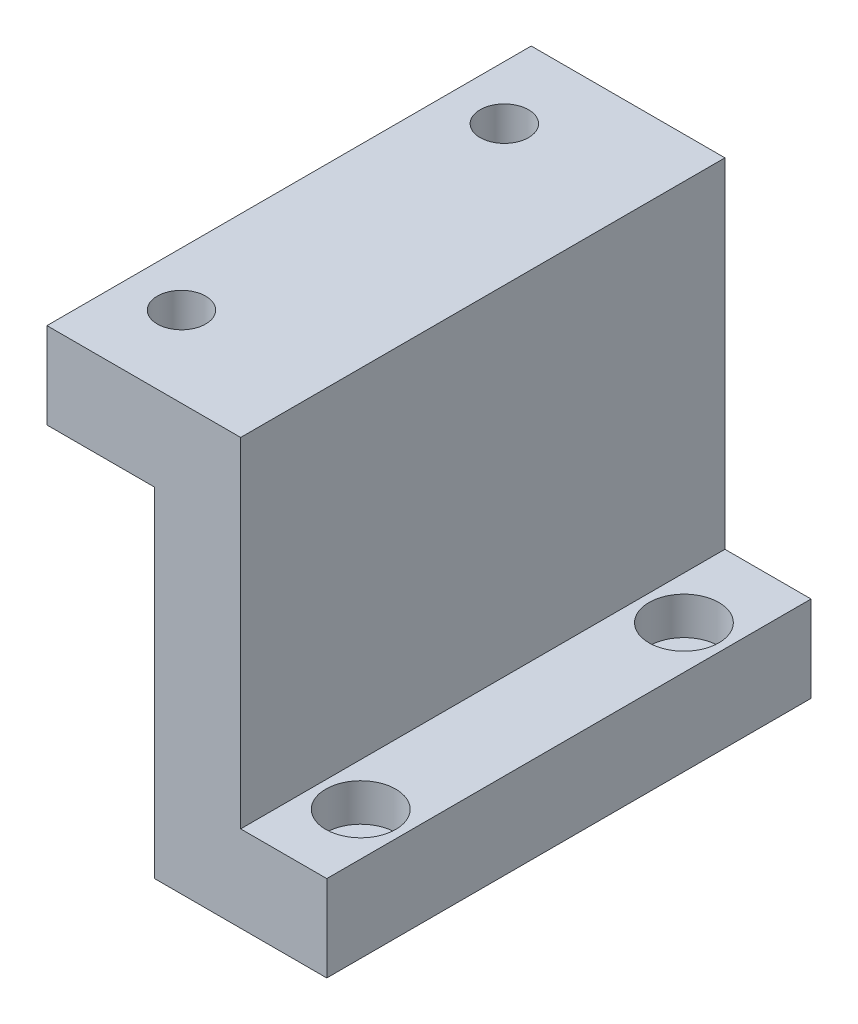
ISO-10303-21;
HEADER;
FILE_DESCRIPTION(('STEP AP214'),'2;1');
FILE_NAME('part.step','',(''),(''),'','','');
FILE_SCHEMA(('AUTOMOTIVE_DESIGN { 1 0 10303 214 1 1 1 1 }'));
ENDSEC;
DATA;
#1=APPLICATION_CONTEXT('core data for automotive mechanical design processes');
#2=APPLICATION_PROTOCOL_DEFINITION('international standard','automotive_design',2000,#1);
#3=PRODUCT_CONTEXT('',#1,'mechanical');
#4=PRODUCT('Part','Part','',(#3));
#5=PRODUCT_RELATED_PRODUCT_CATEGORY('part','',(#4));
#6=PRODUCT_DEFINITION_FORMATION('','',#4);
#7=PRODUCT_DEFINITION_CONTEXT('part definition',#1,'design');
#8=PRODUCT_DEFINITION('design','',#6,#7);
#9=PRODUCT_DEFINITION_SHAPE('','',#8);
#10=(LENGTH_UNIT() NAMED_UNIT(*) SI_UNIT(.MILLI.,.METRE.));
#11=(NAMED_UNIT(*) PLANE_ANGLE_UNIT() SI_UNIT($,.RADIAN.));
#12=(NAMED_UNIT(*) SI_UNIT($,.STERADIAN.) SOLID_ANGLE_UNIT());
#13=UNCERTAINTY_MEASURE_WITH_UNIT(LENGTH_MEASURE(1.E-05),#10,'distance_accuracy_value','');
#14=(GEOMETRIC_REPRESENTATION_CONTEXT(3) GLOBAL_UNCERTAINTY_ASSIGNED_CONTEXT((#13)) GLOBAL_UNIT_ASSIGNED_CONTEXT((#10,
#11,#12)) REPRESENTATION_CONTEXT('',''));
#15=CARTESIAN_POINT('',(0.,0.,0.));
#16=DIRECTION('',(0.,0.,1.));
#17=DIRECTION('',(1.,0.,0.));
#18=AXIS2_PLACEMENT_3D('',#15,#16,#17);
#19=CARTESIAN_POINT('',(17.4113924050633,-67.9588607594937,37.8432212693269));
#20=DIRECTION('',(0.,1.,0.));
#21=DIRECTION('',(0.,0.,1.));
#22=AXIS2_PLACEMENT_3D('',#19,#20,#21);
#23=CYLINDRICAL_SURFACE('',#22,1.7);
#24=CARTESIAN_POINT('',(17.4113924050633,-30.9588607594937,37.8432212693269));
#25=DIRECTION('',(0.,1.,0.));
#26=DIRECTION('',(-1.,0.,0.));
#27=AXIS2_PLACEMENT_3D('',#24,#25,#26);
#28=CIRCLE('',#27,1.7);
#29=CARTESIAN_POINT('',(15.7113924050633,-30.9588607594937,37.8432212693269));
#30=VERTEX_POINT('',#29);
#31=EDGE_CURVE('E160',#30,#30,#28,.T.);
#32=ORIENTED_EDGE('',*,*,#31,.F.);
#33=EDGE_LOOP('',(#32));
#34=FACE_BOUND('',#33,.T.);
#35=CARTESIAN_POINT('',(17.4113924050633,-26.4588607594937,37.8432212693269));
#36=DIRECTION('',(0.,1.,0.));
#37=DIRECTION('',(0.,0.,1.));
#38=AXIS2_PLACEMENT_3D('',#35,#36,#37);
#39=CIRCLE('',#38,1.7);
#40=CARTESIAN_POINT('',(17.4113924050633,-26.4588607594937,39.5432212693269));
#41=VERTEX_POINT('',#40);
#42=EDGE_CURVE('E37',#41,#41,#39,.F.);
#43=ORIENTED_EDGE('',*,*,#42,.F.);
#44=EDGE_LOOP('',(#43));
#45=FACE_BOUND('',#44,.T.);
#46=ADVANCED_FACE('F33',(#34,#45),#23,.F.);
#47=CARTESIAN_POINT('',(17.4113924050633,-67.9588607594937,7.81059951685847));
#48=DIRECTION('',(0.,1.,0.));
#49=DIRECTION('',(0.,0.,1.));
#50=AXIS2_PLACEMENT_3D('',#47,#48,#49);
#51=CYLINDRICAL_SURFACE('',#50,1.7);
#52=CARTESIAN_POINT('',(17.4113924050633,-30.9588607594937,7.81059951685847));
#53=DIRECTION('',(0.,1.,0.));
#54=DIRECTION('',(-1.,0.,0.));
#55=AXIS2_PLACEMENT_3D('',#52,#53,#54);
#56=CIRCLE('',#55,1.7);
#57=CARTESIAN_POINT('',(15.7113924050633,-30.9588607594937,7.81059951685847));
#58=VERTEX_POINT('',#57);
#59=EDGE_CURVE('E165',#58,#58,#56,.T.);
#60=ORIENTED_EDGE('',*,*,#59,.F.);
#61=EDGE_LOOP('',(#60));
#62=FACE_BOUND('',#61,.T.);
#63=CARTESIAN_POINT('',(17.4113924050633,-26.4588607594937,7.81059951685847));
#64=DIRECTION('',(0.,1.,0.));
#65=DIRECTION('',(0.,0.,1.));
#66=AXIS2_PLACEMENT_3D('',#63,#64,#65);
#67=CIRCLE('',#66,1.7);
#68=CARTESIAN_POINT('',(17.4113924050633,-26.4588607594937,9.51059951685847));
#69=VERTEX_POINT('',#68);
#70=EDGE_CURVE('E158',#69,#69,#67,.F.);
#71=ORIENTED_EDGE('',*,*,#70,.F.);
#72=EDGE_LOOP('',(#71));
#73=FACE_BOUND('',#72,.T.);
#74=ADVANCED_FACE('F227',(#62,#73),#51,.F.);
#75=CARTESIAN_POINT('',(-4.5886075949367,8.54113924050633,45.));
#76=DIRECTION('',(1.,0.,0.));
#77=DIRECTION('',(0.,1.,0.));
#78=AXIS2_PLACEMENT_3D('',#75,#76,#77);
#79=PLANE('',#78);
#80=DIRECTION('',(0.,-1.,0.));
#81=VECTOR('',#80,1.);
#82=CARTESIAN_POINT('',(-4.5886075949367,8.54113924050633,0.));
#83=LINE('',#82,#81);
#84=CARTESIAN_POINT('',(-4.5886075949367,8.54113924050633,0.));
#85=VERTEX_POINT('',#84);
#86=CARTESIAN_POINT('',(-4.5886075949367,0.541139240506329,0.));
#87=VERTEX_POINT('',#86);
#88=EDGE_CURVE('E132',#85,#87,#83,.T.);
#89=ORIENTED_EDGE('',*,*,#88,.T.);
#90=DIRECTION('',(0.,0.,-1.));
#91=VECTOR('',#90,1.);
#92=CARTESIAN_POINT('',(-4.5886075949367,0.541139240506329,45.));
#93=LINE('',#92,#91);
#94=CARTESIAN_POINT('',(-4.5886075949367,0.541139240506329,45.));
#95=VERTEX_POINT('',#94);
#96=EDGE_CURVE('E11',#95,#87,#93,.T.);
#97=ORIENTED_EDGE('',*,*,#96,.F.);
#98=DIRECTION('',(0.,-1.,0.));
#99=VECTOR('',#98,1.);
#100=CARTESIAN_POINT('',(-4.5886075949367,8.54113924050633,45.));
#101=LINE('',#100,#99);
#102=CARTESIAN_POINT('',(-4.5886075949367,8.54113924050633,45.));
#103=VERTEX_POINT('',#102);
#104=EDGE_CURVE('E147',#103,#95,#101,.T.);
#105=ORIENTED_EDGE('',*,*,#104,.F.);
#106=DIRECTION('',(0.,0.,-1.));
#107=VECTOR('',#106,1.);
#108=CARTESIAN_POINT('',(-4.5886075949367,8.54113924050633,45.));
#109=LINE('',#108,#107);
#110=EDGE_CURVE('E128',#103,#85,#109,.T.);
#111=ORIENTED_EDGE('',*,*,#110,.T.);
#112=EDGE_LOOP('',(#89,#97,#105,#111));
#113=FACE_BOUND('',#112,.T.);
#114=ADVANCED_FACE('F35',(#113),#79,.F.);
#115=CARTESIAN_POINT('',(-4.5886075949367,0.541139240506329,45.));
#116=DIRECTION('',(0.,1.,0.));
#117=DIRECTION('',(0.,0.,1.));
#118=AXIS2_PLACEMENT_3D('',#115,#116,#117);
#119=PLANE('',#118);
#120=CARTESIAN_POINT('',(0.411392405063299,0.541139240506319,37.5));
#121=DIRECTION('',(0.,1.,0.));
#122=DIRECTION('',(0.,0.,1.));
#123=AXIS2_PLACEMENT_3D('',#120,#121,#122);
#124=CIRCLE('',#123,2.25);
#125=CARTESIAN_POINT('',(0.411392405063299,0.541139240506319,39.75));
#126=VERTEX_POINT('',#125);
#127=EDGE_CURVE('E183',#126,#126,#124,.T.);
#128=ORIENTED_EDGE('',*,*,#127,.T.);
#129=EDGE_LOOP('',(#128));
#130=FACE_BOUND('',#129,.T.);
#131=CARTESIAN_POINT('',(0.411392405063299,0.541139240506319,7.5));
#132=DIRECTION('',(0.,1.,0.));
#133=DIRECTION('',(0.,0.,1.));
#134=AXIS2_PLACEMENT_3D('',#131,#132,#133);
#135=CIRCLE('',#134,2.25);
#136=CARTESIAN_POINT('',(0.411392405063299,0.541139240506319,9.75));
#137=VERTEX_POINT('',#136);
#138=EDGE_CURVE('E136',#137,#137,#135,.T.);
#139=ORIENTED_EDGE('',*,*,#138,.T.);
#140=EDGE_LOOP('',(#139));
#141=FACE_BOUND('',#140,.T.);
#142=DIRECTION('',(1.,0.,0.));
#143=VECTOR('',#142,1.);
#144=CARTESIAN_POINT('',(-4.5886075949367,0.541139240506329,0.));
#145=LINE('',#144,#143);
#146=CARTESIAN_POINT('',(5.4113924050633,0.541139240506329,0.));
#147=VERTEX_POINT('',#146);
#148=EDGE_CURVE('E135',#87,#147,#145,.T.);
#149=ORIENTED_EDGE('',*,*,#148,.T.);
#150=DIRECTION('',(0.,0.,-1.));
#151=VECTOR('',#150,1.);
#152=CARTESIAN_POINT('',(5.4113924050633,0.541139240506329,45.));
#153=LINE('',#152,#151);
#154=CARTESIAN_POINT('',(5.4113924050633,0.541139240506329,45.));
#155=VERTEX_POINT('',#154);
#156=EDGE_CURVE('E43',#155,#147,#153,.T.);
#157=ORIENTED_EDGE('',*,*,#156,.F.);
#158=DIRECTION('',(1.,0.,0.));
#159=VECTOR('',#158,1.);
#160=CARTESIAN_POINT('',(-4.5886075949367,0.541139240506329,45.));
#161=LINE('',#160,#159);
#162=EDGE_CURVE('E95',#95,#155,#161,.T.);
#163=ORIENTED_EDGE('',*,*,#162,.F.);
#164=ORIENTED_EDGE('',*,*,#96,.T.);
#165=EDGE_LOOP('',(#149,#157,#163,#164));
#166=FACE_BOUND('',#165,.T.);
#167=ADVANCED_FACE('F358',(#130,#141,#166),#119,.F.);
#168=CARTESIAN_POINT('',(5.4113924050633,0.541139240506329,45.));
#169=DIRECTION('',(1.,0.,0.));
#170=DIRECTION('',(0.,1.,0.));
#171=AXIS2_PLACEMENT_3D('',#168,#169,#170);
#172=PLANE('',#171);
#173=DIRECTION('',(0.,-1.,0.));
#174=VECTOR('',#173,1.);
#175=CARTESIAN_POINT('',(5.4113924050633,0.541139240506329,0.));
#176=LINE('',#175,#174);
#177=CARTESIAN_POINT('',(5.4113924050633,-30.9588607594937,0.));
#178=VERTEX_POINT('',#177);
#179=EDGE_CURVE('E138',#147,#178,#176,.T.);
#180=ORIENTED_EDGE('',*,*,#179,.T.);
#181=DIRECTION('',(0.,0.,-1.));
#182=VECTOR('',#181,1.);
#183=CARTESIAN_POINT('',(5.4113924050633,-30.9588607594937,45.));
#184=LINE('',#183,#182);
#185=CARTESIAN_POINT('',(5.4113924050633,-30.9588607594937,45.));
#186=VERTEX_POINT('',#185);
#187=EDGE_CURVE('E154',#186,#178,#184,.T.);
#188=ORIENTED_EDGE('',*,*,#187,.F.);
#189=DIRECTION('',(0.,-1.,0.));
#190=VECTOR('',#189,1.);
#191=CARTESIAN_POINT('',(5.4113924050633,0.541139240506329,45.));
#192=LINE('',#191,#190);
#193=EDGE_CURVE('E193',#155,#186,#192,.T.);
#194=ORIENTED_EDGE('',*,*,#193,.F.);
#195=ORIENTED_EDGE('',*,*,#156,.T.);
#196=EDGE_LOOP('',(#180,#188,#194,#195));
#197=FACE_BOUND('',#196,.T.);
#198=ADVANCED_FACE('F350',(#197),#172,.F.);
#199=CARTESIAN_POINT('',(5.4113924050633,-30.9588607594937,45.));
#200=DIRECTION('',(0.,1.,0.));
#201=DIRECTION('',(-1.,0.,0.));
#202=AXIS2_PLACEMENT_3D('',#199,#200,#201);
#203=PLANE('',#202);
#204=ORIENTED_EDGE('',*,*,#31,.T.);
#205=EDGE_LOOP('',(#204));
#206=FACE_BOUND('',#205,.T.);
#207=ORIENTED_EDGE('',*,*,#59,.T.);
#208=EDGE_LOOP('',(#207));
#209=FACE_BOUND('',#208,.T.);
#210=DIRECTION('',(1.,0.,0.));
#211=VECTOR('',#210,1.);
#212=CARTESIAN_POINT('',(5.4113924050633,-30.9588607594937,0.));
#213=LINE('',#212,#211);
#214=CARTESIAN_POINT('',(21.4113924050633,-30.9588607594937,0.));
#215=VERTEX_POINT('',#214);
#216=EDGE_CURVE('E140',#178,#215,#213,.T.);
#217=ORIENTED_EDGE('',*,*,#216,.T.);
#218=DIRECTION('',(0.,0.,-1.));
#219=VECTOR('',#218,1.);
#220=CARTESIAN_POINT('',(21.4113924050633,-30.9588607594937,45.));
#221=LINE('',#220,#219);
#222=CARTESIAN_POINT('',(21.4113924050633,-30.9588607594937,45.));
#223=VERTEX_POINT('',#222);
#224=EDGE_CURVE('E151',#223,#215,#221,.T.);
#225=ORIENTED_EDGE('',*,*,#224,.F.);
#226=DIRECTION('',(1.,0.,0.));
#227=VECTOR('',#226,1.);
#228=CARTESIAN_POINT('',(5.4113924050633,-30.9588607594937,45.));
#229=LINE('',#228,#227);
#230=EDGE_CURVE('E195',#186,#223,#229,.T.);
#231=ORIENTED_EDGE('',*,*,#230,.F.);
#232=ORIENTED_EDGE('',*,*,#187,.T.);
#233=EDGE_LOOP('',(#217,#225,#231,#232));
#234=FACE_BOUND('',#233,.T.);
#235=ADVANCED_FACE('F201',(#206,#209,#234),#203,.F.);
#236=CARTESIAN_POINT('',(21.4113924050633,-30.9588607594937,45.));
#237=DIRECTION('',(-1.,0.,0.));
#238=DIRECTION('',(0.,0.,1.));
#239=AXIS2_PLACEMENT_3D('',#236,#237,#238);
#240=PLANE('',#239);
#241=DIRECTION('',(0.,1.,0.));
#242=VECTOR('',#241,1.);
#243=CARTESIAN_POINT('',(21.4113924050633,-30.9588607594937,0.));
#244=LINE('',#243,#242);
#245=CARTESIAN_POINT('',(21.4113924050633,-22.9588607594937,0.));
#246=VERTEX_POINT('',#245);
#247=EDGE_CURVE('E142',#215,#246,#244,.T.);
#248=ORIENTED_EDGE('',*,*,#247,.T.);
#249=DIRECTION('',(0.,0.,-1.));
#250=VECTOR('',#249,1.);
#251=CARTESIAN_POINT('',(21.4113924050633,-22.9588607594937,45.));
#252=LINE('',#251,#250);
#253=CARTESIAN_POINT('',(21.4113924050633,-22.9588607594937,45.));
#254=VERTEX_POINT('',#253);
#255=EDGE_CURVE('E123',#254,#246,#252,.T.);
#256=ORIENTED_EDGE('',*,*,#255,.F.);
#257=DIRECTION('',(0.,1.,0.));
#258=VECTOR('',#257,1.);
#259=CARTESIAN_POINT('',(21.4113924050633,-30.9588607594937,45.));
#260=LINE('',#259,#258);
#261=EDGE_CURVE('E114',#223,#254,#260,.T.);
#262=ORIENTED_EDGE('',*,*,#261,.F.);
#263=ORIENTED_EDGE('',*,*,#224,.T.);
#264=EDGE_LOOP('',(#248,#256,#262,#263));
#265=FACE_BOUND('',#264,.T.);
#266=ADVANCED_FACE('F205',(#265),#240,.F.);
#267=CARTESIAN_POINT('',(13.4113924050633,-22.9588607594937,45.));
#268=DIRECTION('',(0.,-1.,0.));
#269=DIRECTION('',(0.,0.,-1.));
#270=AXIS2_PLACEMENT_3D('',#267,#268,#269);
#271=PLANE('',#270);
#272=CARTESIAN_POINT('',(17.4113924050633,-22.9588607594937,37.8432212693269));
#273=DIRECTION('',(0.,1.,0.));
#274=DIRECTION('',(0.,0.,1.));
#275=AXIS2_PLACEMENT_3D('',#272,#273,#274);
#276=CIRCLE('',#275,3.25);
#277=CARTESIAN_POINT('',(17.4113924050633,-22.9588607594937,41.0932212693269));
#278=VERTEX_POINT('',#277);
#279=EDGE_CURVE('E175',#278,#278,#276,.T.);
#280=ORIENTED_EDGE('',*,*,#279,.F.);
#281=EDGE_LOOP('',(#280));
#282=FACE_BOUND('',#281,.T.);
#283=CARTESIAN_POINT('',(17.4113924050633,-22.9588607594937,7.81059951685847));
#284=DIRECTION('',(0.,1.,0.));
#285=DIRECTION('',(0.,0.,1.));
#286=AXIS2_PLACEMENT_3D('',#283,#284,#285);
#287=CIRCLE('',#286,3.25);
#288=CARTESIAN_POINT('',(17.4113924050633,-22.9588607594937,11.0605995168585));
#289=VERTEX_POINT('',#288);
#290=EDGE_CURVE('E168',#289,#289,#287,.T.);
#291=ORIENTED_EDGE('',*,*,#290,.F.);
#292=EDGE_LOOP('',(#291));
#293=FACE_BOUND('',#292,.T.);
#294=DIRECTION('',(-1.,0.,0.));
#295=VECTOR('',#294,1.);
#296=CARTESIAN_POINT('',(13.4113924050633,-22.9588607594937,0.));
#297=LINE('',#296,#295);
#298=CARTESIAN_POINT('',(13.4113924050633,-22.9588607594937,0.));
#299=VERTEX_POINT('',#298);
#300=EDGE_CURVE('E122',#246,#299,#297,.T.);
#301=ORIENTED_EDGE('',*,*,#300,.T.);
#302=DIRECTION('',(0.,0.,-1.));
#303=VECTOR('',#302,1.);
#304=CARTESIAN_POINT('',(13.4113924050633,-22.9588607594937,45.));
#305=LINE('',#304,#303);
#306=CARTESIAN_POINT('',(13.4113924050633,-22.9588607594937,45.));
#307=VERTEX_POINT('',#306);
#308=EDGE_CURVE('E119',#307,#299,#305,.T.);
#309=ORIENTED_EDGE('',*,*,#308,.F.);
#310=DIRECTION('',(-1.,0.,0.));
#311=VECTOR('',#310,1.);
#312=CARTESIAN_POINT('',(13.4113924050633,-22.9588607594937,45.));
#313=LINE('',#312,#311);
#314=EDGE_CURVE('E108',#254,#307,#313,.T.);
#315=ORIENTED_EDGE('',*,*,#314,.F.);
#316=ORIENTED_EDGE('',*,*,#255,.T.);
#317=EDGE_LOOP('',(#301,#309,#315,#316));
#318=FACE_BOUND('',#317,.T.);
#319=ADVANCED_FACE('F120',(#282,#293,#318),#271,.F.);
#320=CARTESIAN_POINT('',(13.4113924050633,8.54113924050633,45.));
#321=DIRECTION('',(-1.,0.,0.));
#322=DIRECTION('',(0.,-1.,0.));
#323=AXIS2_PLACEMENT_3D('',#320,#321,#322);
#324=PLANE('',#323);
#325=DIRECTION('',(0.,1.,0.));
#326=VECTOR('',#325,1.);
#327=CARTESIAN_POINT('',(13.4113924050633,8.54113924050633,0.));
#328=LINE('',#327,#326);
#329=CARTESIAN_POINT('',(13.4113924050633,8.54113924050633,0.));
#330=VERTEX_POINT('',#329);
#331=EDGE_CURVE('E81',#299,#330,#328,.T.);
#332=ORIENTED_EDGE('',*,*,#331,.T.);
#333=DIRECTION('',(0.,0.,-1.));
#334=VECTOR('',#333,1.);
#335=CARTESIAN_POINT('',(13.4113924050633,8.54113924050633,45.));
#336=LINE('',#335,#334);
#337=CARTESIAN_POINT('',(13.4113924050633,8.54113924050633,45.));
#338=VERTEX_POINT('',#337);
#339=EDGE_CURVE('E124',#338,#330,#336,.T.);
#340=ORIENTED_EDGE('',*,*,#339,.F.);
#341=DIRECTION('',(0.,1.,0.));
#342=VECTOR('',#341,1.);
#343=CARTESIAN_POINT('',(13.4113924050633,8.54113924050633,45.));
#344=LINE('',#343,#342);
#345=EDGE_CURVE('E112',#307,#338,#344,.T.);
#346=ORIENTED_EDGE('',*,*,#345,.F.);
#347=ORIENTED_EDGE('',*,*,#308,.T.);
#348=EDGE_LOOP('',(#332,#340,#346,#347));
#349=FACE_BOUND('',#348,.T.);
#350=ADVANCED_FACE('F126',(#349),#324,.F.);
#351=CARTESIAN_POINT('',(-4.5886075949367,8.54113924050633,45.));
#352=DIRECTION('',(0.,-1.,0.));
#353=DIRECTION('',(0.,0.,-1.));
#354=AXIS2_PLACEMENT_3D('',#351,#352,#353);
#355=PLANE('',#354);
#356=CARTESIAN_POINT('',(0.411392405063299,8.54113924050633,37.5));
#357=DIRECTION('',(0.,1.,0.));
#358=DIRECTION('',(0.,0.,1.));
#359=AXIS2_PLACEMENT_3D('',#356,#357,#358);
#360=CIRCLE('',#359,2.25);
#361=CARTESIAN_POINT('',(0.411392405063299,8.54113924050633,39.75));
#362=VERTEX_POINT('',#361);
#363=EDGE_CURVE('E180',#362,#362,#360,.T.);
#364=ORIENTED_EDGE('',*,*,#363,.F.);
#365=EDGE_LOOP('',(#364));
#366=FACE_BOUND('',#365,.T.);
#367=CARTESIAN_POINT('',(0.411392405063299,8.54113924050633,7.5));
#368=DIRECTION('',(0.,1.,0.));
#369=DIRECTION('',(0.,0.,1.));
#370=AXIS2_PLACEMENT_3D('',#367,#368,#369);
#371=CIRCLE('',#370,2.25);
#372=CARTESIAN_POINT('',(0.411392405063299,8.54113924050633,9.75));
#373=VERTEX_POINT('',#372);
#374=EDGE_CURVE('E186',#373,#373,#371,.T.);
#375=ORIENTED_EDGE('',*,*,#374,.F.);
#376=EDGE_LOOP('',(#375));
#377=FACE_BOUND('',#376,.T.);
#378=DIRECTION('',(-1.,0.,0.));
#379=VECTOR('',#378,1.);
#380=CARTESIAN_POINT('',(-4.5886075949367,8.54113924050633,0.));
#381=LINE('',#380,#379);
#382=EDGE_CURVE('E87',#330,#85,#381,.T.);
#383=ORIENTED_EDGE('',*,*,#382,.T.);
#384=ORIENTED_EDGE('',*,*,#110,.F.);
#385=DIRECTION('',(-1.,0.,0.));
#386=VECTOR('',#385,1.);
#387=CARTESIAN_POINT('',(-4.5886075949367,8.54113924050633,45.));
#388=LINE('',#387,#386);
#389=EDGE_CURVE('E52',#338,#103,#388,.T.);
#390=ORIENTED_EDGE('',*,*,#389,.F.);
#391=ORIENTED_EDGE('',*,*,#339,.T.);
#392=EDGE_LOOP('',(#383,#384,#390,#391));
#393=FACE_BOUND('',#392,.T.);
#394=ADVANCED_FACE('F213',(#366,#377,#393),#355,.F.);
#395=CARTESIAN_POINT('',(0.,0.,45.));
#396=DIRECTION('',(0.,0.,1.));
#397=DIRECTION('',(1.,0.,0.));
#398=AXIS2_PLACEMENT_3D('',#395,#396,#397);
#399=PLANE('',#398);
#400=ORIENTED_EDGE('',*,*,#104,.T.);
#401=ORIENTED_EDGE('',*,*,#162,.T.);
#402=ORIENTED_EDGE('',*,*,#193,.T.);
#403=ORIENTED_EDGE('',*,*,#230,.T.);
#404=ORIENTED_EDGE('',*,*,#261,.T.);
#405=ORIENTED_EDGE('',*,*,#314,.T.);
#406=ORIENTED_EDGE('',*,*,#345,.T.);
#407=ORIENTED_EDGE('',*,*,#389,.T.);
#408=EDGE_LOOP('',(#400,#401,#402,#403,#404,#405,#406,#407));
#409=FACE_BOUND('',#408,.T.);
#410=ADVANCED_FACE('F110',(#409),#399,.T.);
#411=CARTESIAN_POINT('',(0.,0.,0.));
#412=DIRECTION('',(0.,0.,1.));
#413=DIRECTION('',(1.,0.,0.));
#414=AXIS2_PLACEMENT_3D('',#411,#412,#413);
#415=PLANE('',#414);
#416=ORIENTED_EDGE('',*,*,#88,.F.);
#417=ORIENTED_EDGE('',*,*,#382,.F.);
#418=ORIENTED_EDGE('',*,*,#331,.F.);
#419=ORIENTED_EDGE('',*,*,#300,.F.);
#420=ORIENTED_EDGE('',*,*,#247,.F.);
#421=ORIENTED_EDGE('',*,*,#216,.F.);
#422=ORIENTED_EDGE('',*,*,#179,.F.);
#423=ORIENTED_EDGE('',*,*,#148,.F.);
#424=EDGE_LOOP('',(#416,#417,#418,#419,#420,#421,#422,#423));
#425=FACE_BOUND('',#424,.T.);
#426=ADVANCED_FACE('F208',(#425),#415,.F.);
#427=CARTESIAN_POINT('',(0.411392405063299,-36.4588607594937,7.5));
#428=DIRECTION('',(0.,1.,0.));
#429=DIRECTION('',(0.,0.,1.));
#430=AXIS2_PLACEMENT_3D('',#427,#428,#429);
#431=CYLINDRICAL_SURFACE('',#430,2.25);
#432=ORIENTED_EDGE('',*,*,#374,.T.);
#433=EDGE_LOOP('',(#432));
#434=FACE_BOUND('',#433,.T.);
#435=ORIENTED_EDGE('',*,*,#138,.F.);
#436=EDGE_LOOP('',(#435));
#437=FACE_BOUND('',#436,.T.);
#438=ADVANCED_FACE('F245',(#434,#437),#431,.F.);
#439=CARTESIAN_POINT('',(0.411392405063299,-36.4588607594937,37.5));
#440=DIRECTION('',(0.,1.,0.));
#441=DIRECTION('',(0.,0.,1.));
#442=AXIS2_PLACEMENT_3D('',#439,#440,#441);
#443=CYLINDRICAL_SURFACE('',#442,2.25);
#444=ORIENTED_EDGE('',*,*,#363,.T.);
#445=EDGE_LOOP('',(#444));
#446=FACE_BOUND('',#445,.T.);
#447=ORIENTED_EDGE('',*,*,#127,.F.);
#448=EDGE_LOOP('',(#447));
#449=FACE_BOUND('',#448,.T.);
#450=ADVANCED_FACE('F241',(#446,#449),#443,.F.);
#451=CARTESIAN_POINT('',(17.4113924050633,-26.4588607594937,7.81059951685847));
#452=DIRECTION('',(0.,1.,0.));
#453=DIRECTION('',(0.,0.,1.));
#454=AXIS2_PLACEMENT_3D('',#451,#452,#453);
#455=PLANE('',#454);
#456=CARTESIAN_POINT('',(17.4113924050633,-26.4588607594937,7.81059951685847));
#457=DIRECTION('',(0.,1.,0.));
#458=DIRECTION('',(0.,0.,1.));
#459=AXIS2_PLACEMENT_3D('',#456,#457,#458);
#460=CIRCLE('',#459,3.25);
#461=CARTESIAN_POINT('',(17.4113924050633,-26.4588607594937,11.0605995168585));
#462=VERTEX_POINT('',#461);
#463=EDGE_CURVE('E161',#462,#462,#460,.T.);
#464=ORIENTED_EDGE('',*,*,#463,.T.);
#465=EDGE_LOOP('',(#464));
#466=FACE_BOUND('',#465,.T.);
#467=ORIENTED_EDGE('',*,*,#70,.T.);
#468=EDGE_LOOP('',(#467));
#469=FACE_BOUND('',#468,.T.);
#470=ADVANCED_FACE('F244',(#466,#469),#455,.T.);
#471=CARTESIAN_POINT('',(17.4113924050633,-26.4588607594937,7.81059951685847));
#472=DIRECTION('',(0.,1.,0.));
#473=DIRECTION('',(0.,0.,1.));
#474=AXIS2_PLACEMENT_3D('',#471,#472,#473);
#475=CYLINDRICAL_SURFACE('',#474,3.25);
#476=ORIENTED_EDGE('',*,*,#463,.F.);
#477=EDGE_LOOP('',(#476));
#478=FACE_BOUND('',#477,.T.);
#479=ORIENTED_EDGE('',*,*,#290,.T.);
#480=EDGE_LOOP('',(#479));
#481=FACE_BOUND('',#480,.T.);
#482=ADVANCED_FACE('F238',(#478,#481),#475,.F.);
#483=CARTESIAN_POINT('',(17.4113924050633,-26.4588607594937,37.8432212693269));
#484=DIRECTION('',(0.,1.,0.));
#485=DIRECTION('',(0.,0.,1.));
#486=AXIS2_PLACEMENT_3D('',#483,#484,#485);
#487=PLANE('',#486);
#488=CARTESIAN_POINT('',(17.4113924050633,-26.4588607594937,37.8432212693269));
#489=DIRECTION('',(0.,1.,0.));
#490=DIRECTION('',(0.,0.,1.));
#491=AXIS2_PLACEMENT_3D('',#488,#489,#490);
#492=CIRCLE('',#491,3.25);
#493=CARTESIAN_POINT('',(17.4113924050633,-26.4588607594937,41.0932212693269));
#494=VERTEX_POINT('',#493);
#495=EDGE_CURVE('E395',#494,#494,#492,.T.);
#496=ORIENTED_EDGE('',*,*,#495,.T.);
#497=EDGE_LOOP('',(#496));
#498=FACE_BOUND('',#497,.T.);
#499=ORIENTED_EDGE('',*,*,#42,.T.);
#500=EDGE_LOOP('',(#499));
#501=FACE_BOUND('',#500,.T.);
#502=ADVANCED_FACE('F276',(#498,#501),#487,.T.);
#503=CARTESIAN_POINT('',(17.4113924050633,-26.4588607594937,37.8432212693269));
#504=DIRECTION('',(0.,1.,0.));
#505=DIRECTION('',(0.,0.,1.));
#506=AXIS2_PLACEMENT_3D('',#503,#504,#505);
#507=CYLINDRICAL_SURFACE('',#506,3.25);
#508=ORIENTED_EDGE('',*,*,#495,.F.);
#509=EDGE_LOOP('',(#508));
#510=FACE_BOUND('',#509,.T.);
#511=ORIENTED_EDGE('',*,*,#279,.T.);
#512=EDGE_LOOP('',(#511));
#513=FACE_BOUND('',#512,.T.);
#514=ADVANCED_FACE('F283',(#510,#513),#507,.F.);
#515=CLOSED_SHELL('',(#46,#74,#114,#167,#198,#235,#266,#319,#350,#394,#410,#426,#438,#450,#470,
#482,#502,#514));
#516=MANIFOLD_SOLID_BREP('B2',#515);
#517=ADVANCED_BREP_SHAPE_REPRESENTATION('',(#18,#516),#14);
#518=SHAPE_DEFINITION_REPRESENTATION(#9,#517);
ENDSEC;
END-ISO-10303-21;
